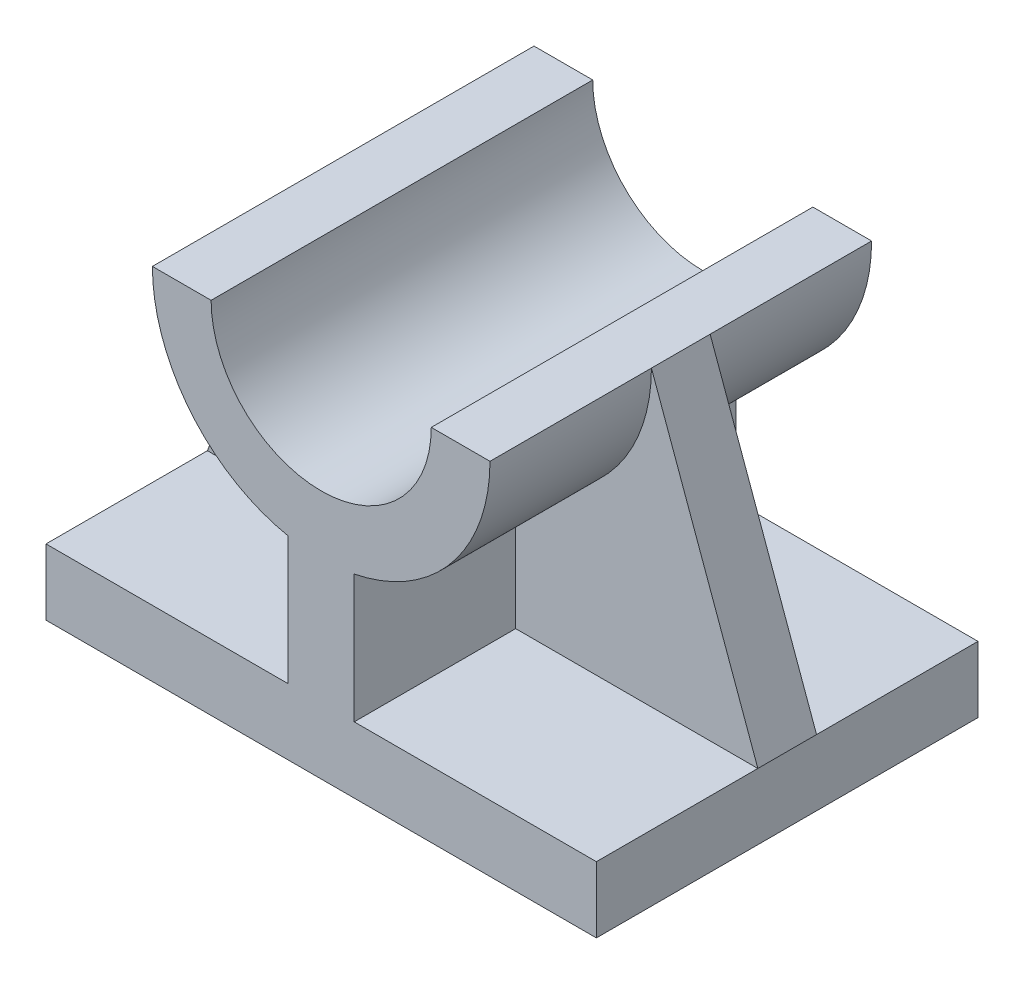
ISO-10303-21;
HEADER;
FILE_DESCRIPTION(('STEP AP214'),'2;1');
FILE_NAME('part.step','',(''),(''),'','','');
FILE_SCHEMA(('AUTOMOTIVE_DESIGN { 1 0 10303 214 1 1 1 1 }'));
ENDSEC;
DATA;
#1=APPLICATION_CONTEXT('core data for automotive mechanical design processes');
#2=APPLICATION_PROTOCOL_DEFINITION('international standard','automotive_design',2000,#1);
#3=PRODUCT_CONTEXT('',#1,'mechanical');
#4=PRODUCT('Part','Part','',(#3));
#5=PRODUCT_RELATED_PRODUCT_CATEGORY('part','',(#4));
#6=PRODUCT_DEFINITION_FORMATION('','',#4);
#7=PRODUCT_DEFINITION_CONTEXT('part definition',#1,'design');
#8=PRODUCT_DEFINITION('design','',#6,#7);
#9=PRODUCT_DEFINITION_SHAPE('','',#8);
#10=(LENGTH_UNIT() NAMED_UNIT(*) SI_UNIT(.MILLI.,.METRE.));
#11=(NAMED_UNIT(*) PLANE_ANGLE_UNIT() SI_UNIT($,.RADIAN.));
#12=(NAMED_UNIT(*) SI_UNIT($,.STERADIAN.) SOLID_ANGLE_UNIT());
#13=UNCERTAINTY_MEASURE_WITH_UNIT(LENGTH_MEASURE(1.E-05),#10,'distance_accuracy_value','');
#14=(GEOMETRIC_REPRESENTATION_CONTEXT(3) GLOBAL_UNCERTAINTY_ASSIGNED_CONTEXT((#13)) GLOBAL_UNIT_ASSIGNED_CONTEXT((#10,
#11,#12)) REPRESENTATION_CONTEXT('',''));
#15=CARTESIAN_POINT('',(0.,0.,0.));
#16=DIRECTION('',(0.,0.,1.));
#17=DIRECTION('',(1.,0.,0.));
#18=AXIS2_PLACEMENT_3D('',#15,#16,#17);
#19=CARTESIAN_POINT('',(-37.5,4.5,-26.));
#20=DIRECTION('',(0.,1.,0.));
#21=DIRECTION('',(-1.,0.,0.));
#22=AXIS2_PLACEMENT_3D('',#19,#20,#21);
#23=PLANE('',#22);
#24=DIRECTION('',(0.,0.,1.));
#25=VECTOR('',#24,1.);
#26=CARTESIAN_POINT('',(-37.5,4.5,-26.));
#27=LINE('',#26,#25);
#28=CARTESIAN_POINT('',(-37.5,4.5,-26.));
#29=VERTEX_POINT('',#28);
#30=CARTESIAN_POINT('',(-37.5,4.5,-4.));
#31=VERTEX_POINT('',#30);
#32=EDGE_CURVE('E267',#29,#31,#27,.T.);
#33=ORIENTED_EDGE('',*,*,#32,.T.);
#34=DIRECTION('',(1.,0.,0.));
#35=VECTOR('',#34,1.);
#36=CARTESIAN_POINT('',(-37.5,4.5,-4.));
#37=LINE('',#36,#35);
#38=CARTESIAN_POINT('',(-4.5,4.5,-4.));
#39=VERTEX_POINT('',#38);
#40=EDGE_CURVE('E200',#31,#39,#37,.T.);
#41=ORIENTED_EDGE('',*,*,#40,.T.);
#42=DIRECTION('',(0.,0.,1.));
#43=VECTOR('',#42,1.);
#44=CARTESIAN_POINT('',(-4.5,4.5,-26.));
#45=LINE('',#44,#43);
#46=CARTESIAN_POINT('',(-4.5,4.5,-26.));
#47=VERTEX_POINT('',#46);
#48=EDGE_CURVE('E277',#47,#39,#45,.T.);
#49=ORIENTED_EDGE('',*,*,#48,.F.);
#50=DIRECTION('',(-1.,0.,0.));
#51=VECTOR('',#50,1.);
#52=CARTESIAN_POINT('',(-37.5,4.5,-26.));
#53=LINE('',#52,#51);
#54=EDGE_CURVE('E357',#47,#29,#53,.T.);
#55=ORIENTED_EDGE('',*,*,#54,.T.);
#56=EDGE_LOOP('',(#33,#41,#49,#55));
#57=FACE_BOUND('',#56,.T.);
#58=ADVANCED_FACE('F47',(#57),#23,.T.);
#59=CARTESIAN_POINT('',(-4.5,4.5,-26.));
#60=DIRECTION('',(-1.,0.,0.));
#61=DIRECTION('',(0.,0.,1.));
#62=AXIS2_PLACEMENT_3D('',#59,#60,#61);
#63=PLANE('',#62);
#64=ORIENTED_EDGE('',*,*,#48,.T.);
#65=DIRECTION('',(0.,1.,0.));
#66=VECTOR('',#65,1.);
#67=CARTESIAN_POINT('',(-4.5,4.5,-4.));
#68=LINE('',#67,#66);
#69=CARTESIAN_POINT('',(-4.5,21.9445128627201,-4.));
#70=VERTEX_POINT('',#69);
#71=EDGE_CURVE('E211',#39,#70,#68,.T.);
#72=ORIENTED_EDGE('',*,*,#71,.T.);
#73=DIRECTION('',(0.,0.,1.));
#74=VECTOR('',#73,1.);
#75=CARTESIAN_POINT('',(-4.5,21.9445128627201,-26.));
#76=LINE('',#75,#74);
#77=CARTESIAN_POINT('',(-4.5,21.9445128627201,-26.));
#78=VERTEX_POINT('',#77);
#79=EDGE_CURVE('E208',#78,#70,#76,.T.);
#80=ORIENTED_EDGE('',*,*,#79,.F.);
#81=DIRECTION('',(0.,-1.,0.));
#82=VECTOR('',#81,1.);
#83=CARTESIAN_POINT('',(-4.5,4.5,-26.));
#84=LINE('',#83,#82);
#85=EDGE_CURVE('E353',#78,#47,#84,.T.);
#86=ORIENTED_EDGE('',*,*,#85,.T.);
#87=EDGE_LOOP('',(#64,#72,#80,#86));
#88=FACE_BOUND('',#87,.T.);
#89=ADVANCED_FACE('F475',(#88),#63,.T.);
#90=CARTESIAN_POINT('',(0.,44.5,-26.));
#91=DIRECTION('',(0.,0.,1.));
#92=DIRECTION('',(1.,0.,0.));
#93=AXIS2_PLACEMENT_3D('',#90,#91,#92);
#94=CYLINDRICAL_SURFACE('',#93,23.);
#95=ORIENTED_EDGE('',*,*,#79,.T.);
#96=CARTESIAN_POINT('',(0.,44.5,-4.));
#97=DIRECTION('',(0.,0.,1.));
#98=DIRECTION('',(1.,0.,0.));
#99=AXIS2_PLACEMENT_3D('',#96,#97,#98);
#100=CIRCLE('',#99,23.);
#101=CARTESIAN_POINT('',(-23.,44.5,-4.));
#102=VERTEX_POINT('',#101);
#103=EDGE_CURVE('E197',#70,#102,#100,.F.);
#104=ORIENTED_EDGE('',*,*,#103,.T.);
#105=DIRECTION('',(0.,0.,1.));
#106=VECTOR('',#105,1.);
#107=CARTESIAN_POINT('',(-23.,44.5,-26.));
#108=LINE('',#107,#106);
#109=CARTESIAN_POINT('',(-23.,44.5,-26.));
#110=VERTEX_POINT('',#109);
#111=EDGE_CURVE('E191',#110,#102,#108,.T.);
#112=ORIENTED_EDGE('',*,*,#111,.F.);
#113=CARTESIAN_POINT('',(0.,44.5,-26.));
#114=DIRECTION('',(0.,0.,1.));
#115=DIRECTION('',(1.,0.,0.));
#116=AXIS2_PLACEMENT_3D('',#113,#114,#115);
#117=CIRCLE('',#116,23.);
#118=EDGE_CURVE('E350',#110,#78,#117,.T.);
#119=ORIENTED_EDGE('',*,*,#118,.T.);
#120=EDGE_LOOP('',(#95,#104,#112,#119));
#121=FACE_BOUND('',#120,.T.);
#122=ADVANCED_FACE('F205',(#121),#94,.T.);
#123=CARTESIAN_POINT('',(0.,44.5,-26.));
#124=DIRECTION('',(0.,0.,1.));
#125=DIRECTION('',(1.,0.,0.));
#126=AXIS2_PLACEMENT_3D('',#123,#124,#125);
#127=CYLINDRICAL_SURFACE('',#126,23.);
#128=DIRECTION('',(0.,0.,1.));
#129=VECTOR('',#128,1.);
#130=CARTESIAN_POINT('',(23.,44.5,-26.));
#131=LINE('',#130,#129);
#132=CARTESIAN_POINT('',(23.,44.5,-26.));
#133=VERTEX_POINT('',#132);
#134=CARTESIAN_POINT('',(23.,44.5,-4.));
#135=VERTEX_POINT('',#134);
#136=EDGE_CURVE('E233',#133,#135,#131,.T.);
#137=ORIENTED_EDGE('',*,*,#136,.T.);
#138=CARTESIAN_POINT('',(0.,44.5,-4.));
#139=DIRECTION('',(0.,0.,1.));
#140=DIRECTION('',(1.,0.,0.));
#141=AXIS2_PLACEMENT_3D('',#138,#139,#140);
#142=CIRCLE('',#141,23.);
#143=CARTESIAN_POINT('',(4.5,21.9445128627201,-4.));
#144=VERTEX_POINT('',#143);
#145=EDGE_CURVE('E407',#135,#144,#142,.F.);
#146=ORIENTED_EDGE('',*,*,#145,.T.);
#147=DIRECTION('',(0.,0.,1.));
#148=VECTOR('',#147,1.);
#149=CARTESIAN_POINT('',(4.50000000000001,21.9445128627201,-26.));
#150=LINE('',#149,#148);
#151=CARTESIAN_POINT('',(4.50000000000001,21.9445128627201,-26.));
#152=VERTEX_POINT('',#151);
#153=EDGE_CURVE('E240',#152,#144,#150,.T.);
#154=ORIENTED_EDGE('',*,*,#153,.F.);
#155=CARTESIAN_POINT('',(0.,44.5,-26.));
#156=DIRECTION('',(0.,0.,1.));
#157=DIRECTION('',(1.,0.,0.));
#158=AXIS2_PLACEMENT_3D('',#155,#156,#157);
#159=CIRCLE('',#158,23.);
#160=EDGE_CURVE('E337',#152,#133,#159,.T.);
#161=ORIENTED_EDGE('',*,*,#160,.T.);
#162=EDGE_LOOP('',(#137,#146,#154,#161));
#163=FACE_BOUND('',#162,.T.);
#164=ADVANCED_FACE('F405',(#163),#127,.T.);
#165=CARTESIAN_POINT('',(4.5,4.5,-26.));
#166=DIRECTION('',(1.,0.,0.));
#167=DIRECTION('',(0.,0.,-1.));
#168=AXIS2_PLACEMENT_3D('',#165,#166,#167);
#169=PLANE('',#168);
#170=ORIENTED_EDGE('',*,*,#153,.T.);
#171=DIRECTION('',(0.,-1.,0.));
#172=VECTOR('',#171,1.);
#173=CARTESIAN_POINT('',(4.5,4.5,-4.));
#174=LINE('',#173,#172);
#175=CARTESIAN_POINT('',(4.5,4.5,-4.));
#176=VERTEX_POINT('',#175);
#177=EDGE_CURVE('E411',#144,#176,#174,.T.);
#178=ORIENTED_EDGE('',*,*,#177,.T.);
#179=DIRECTION('',(0.,0.,1.));
#180=VECTOR('',#179,1.);
#181=CARTESIAN_POINT('',(4.5,4.5,-26.));
#182=LINE('',#181,#180);
#183=CARTESIAN_POINT('',(4.5,4.5,-26.));
#184=VERTEX_POINT('',#183);
#185=EDGE_CURVE('E245',#184,#176,#182,.T.);
#186=ORIENTED_EDGE('',*,*,#185,.F.);
#187=DIRECTION('',(0.,1.,0.));
#188=VECTOR('',#187,1.);
#189=CARTESIAN_POINT('',(4.5,4.5,-26.));
#190=LINE('',#189,#188);
#191=EDGE_CURVE('E328',#184,#152,#190,.T.);
#192=ORIENTED_EDGE('',*,*,#191,.T.);
#193=EDGE_LOOP('',(#170,#178,#186,#192));
#194=FACE_BOUND('',#193,.T.);
#195=ADVANCED_FACE('F410',(#194),#169,.T.);
#196=CARTESIAN_POINT('',(4.5,4.5,-26.));
#197=DIRECTION('',(0.,1.,0.));
#198=DIRECTION('',(-1.,0.,0.));
#199=AXIS2_PLACEMENT_3D('',#196,#197,#198);
#200=PLANE('',#199);
#201=ORIENTED_EDGE('',*,*,#185,.T.);
#202=DIRECTION('',(1.,0.,0.));
#203=VECTOR('',#202,1.);
#204=CARTESIAN_POINT('',(4.5,4.5,-4.));
#205=LINE('',#204,#203);
#206=CARTESIAN_POINT('',(37.5,4.5,-4.00000000000001));
#207=VERTEX_POINT('',#206);
#208=EDGE_CURVE('E56',#176,#207,#205,.T.);
#209=ORIENTED_EDGE('',*,*,#208,.T.);
#210=DIRECTION('',(0.,0.,1.));
#211=VECTOR('',#210,1.);
#212=CARTESIAN_POINT('',(37.5,4.5,-26.));
#213=LINE('',#212,#211);
#214=CARTESIAN_POINT('',(37.5,4.5,-26.));
#215=VERTEX_POINT('',#214);
#216=EDGE_CURVE('E250',#215,#207,#213,.T.);
#217=ORIENTED_EDGE('',*,*,#216,.F.);
#218=DIRECTION('',(-1.,0.,0.));
#219=VECTOR('',#218,1.);
#220=CARTESIAN_POINT('',(4.5,4.5,-26.));
#221=LINE('',#220,#219);
#222=EDGE_CURVE('E322',#215,#184,#221,.T.);
#223=ORIENTED_EDGE('',*,*,#222,.T.);
#224=EDGE_LOOP('',(#201,#209,#217,#223));
#225=FACE_BOUND('',#224,.T.);
#226=ADVANCED_FACE('F413',(#225),#200,.T.);
#227=CARTESIAN_POINT('',(37.5,4.5,-26.));
#228=DIRECTION('',(1.,0.,0.));
#229=DIRECTION('',(0.,0.,-1.));
#230=AXIS2_PLACEMENT_3D('',#227,#228,#229);
#231=PLANE('',#230);
#232=DIRECTION('',(0.,1.,0.));
#233=VECTOR('',#232,1.);
#234=CARTESIAN_POINT('',(37.5,4.5,26.));
#235=LINE('',#234,#233);
#236=CARTESIAN_POINT('',(37.5,-4.5,26.));
#237=VERTEX_POINT('',#236);
#238=CARTESIAN_POINT('',(37.5,4.5,26.));
#239=VERTEX_POINT('',#238);
#240=EDGE_CURVE('E368',#237,#239,#235,.T.);
#241=ORIENTED_EDGE('',*,*,#240,.F.);
#242=DIRECTION('',(0.,0.,1.));
#243=VECTOR('',#242,1.);
#244=CARTESIAN_POINT('',(37.5,-4.5,-26.));
#245=LINE('',#244,#243);
#246=CARTESIAN_POINT('',(37.5,-4.5,-26.));
#247=VERTEX_POINT('',#246);
#248=EDGE_CURVE('E257',#247,#237,#245,.T.);
#249=ORIENTED_EDGE('',*,*,#248,.F.);
#250=DIRECTION('',(0.,1.,0.));
#251=VECTOR('',#250,1.);
#252=CARTESIAN_POINT('',(37.5,4.5,-26.));
#253=LINE('',#252,#251);
#254=EDGE_CURVE('E319',#247,#215,#253,.T.);
#255=ORIENTED_EDGE('',*,*,#254,.T.);
#256=ORIENTED_EDGE('',*,*,#216,.T.);
#257=CARTESIAN_POINT('',(37.5,4.5,4.));
#258=VERTEX_POINT('',#257);
#259=EDGE_CURVE('E253',#207,#258,#213,.T.);
#260=ORIENTED_EDGE('',*,*,#259,.T.);
#261=EDGE_CURVE('E254',#258,#239,#213,.T.);
#262=ORIENTED_EDGE('',*,*,#261,.T.);
#263=EDGE_LOOP('',(#241,#249,#255,#256,#260,#262));
#264=FACE_BOUND('',#263,.T.);
#265=ADVANCED_FACE('F49',(#264),#231,.T.);
#266=CARTESIAN_POINT('',(-37.5,-4.5,-26.));
#267=DIRECTION('',(0.,-1.,0.));
#268=DIRECTION('',(0.,0.,-1.));
#269=AXIS2_PLACEMENT_3D('',#266,#267,#268);
#270=PLANE('',#269);
#271=DIRECTION('',(1.,0.,0.));
#272=VECTOR('',#271,1.);
#273=CARTESIAN_POINT('',(-37.5,-4.5,26.));
#274=LINE('',#273,#272);
#275=CARTESIAN_POINT('',(-37.5,-4.5,26.));
#276=VERTEX_POINT('',#275);
#277=EDGE_CURVE('E270',#276,#237,#274,.T.);
#278=ORIENTED_EDGE('',*,*,#277,.F.);
#279=DIRECTION('',(0.,0.,1.));
#280=VECTOR('',#279,1.);
#281=CARTESIAN_POINT('',(-37.5,-4.5,-26.));
#282=LINE('',#281,#280);
#283=CARTESIAN_POINT('',(-37.5,-4.5,-26.));
#284=VERTEX_POINT('',#283);
#285=EDGE_CURVE('E260',#284,#276,#282,.T.);
#286=ORIENTED_EDGE('',*,*,#285,.F.);
#287=DIRECTION('',(1.,0.,0.));
#288=VECTOR('',#287,1.);
#289=CARTESIAN_POINT('',(-37.5,-4.5,-26.));
#290=LINE('',#289,#288);
#291=EDGE_CURVE('E365',#284,#247,#290,.T.);
#292=ORIENTED_EDGE('',*,*,#291,.T.);
#293=ORIENTED_EDGE('',*,*,#248,.T.);
#294=EDGE_LOOP('',(#278,#286,#292,#293));
#295=FACE_BOUND('',#294,.T.);
#296=ADVANCED_FACE('F471',(#295),#270,.T.);
#297=CARTESIAN_POINT('',(-37.5,4.5,-26.));
#298=DIRECTION('',(-1.,0.,0.));
#299=DIRECTION('',(0.,0.,1.));
#300=AXIS2_PLACEMENT_3D('',#297,#298,#299);
#301=PLANE('',#300);
#302=CARTESIAN_POINT('',(-37.5,4.5,4.));
#303=VERTEX_POINT('',#302);
#304=CARTESIAN_POINT('',(-37.5,4.5,26.));
#305=VERTEX_POINT('',#304);
#306=EDGE_CURVE('E276',#303,#305,#27,.T.);
#307=ORIENTED_EDGE('',*,*,#306,.F.);
#308=DIRECTION('',(0.,0.,1.));
#309=VECTOR('',#308,1.);
#310=CARTESIAN_POINT('',(-37.5,4.5,-26.));
#311=LINE('',#310,#309);
#312=EDGE_CURVE('E446',#31,#303,#311,.T.);
#313=ORIENTED_EDGE('',*,*,#312,.F.);
#314=ORIENTED_EDGE('',*,*,#32,.F.);
#315=DIRECTION('',(0.,-1.,0.));
#316=VECTOR('',#315,1.);
#317=CARTESIAN_POINT('',(-37.5,4.5,-26.));
#318=LINE('',#317,#316);
#319=EDGE_CURVE('E361',#29,#284,#318,.T.);
#320=ORIENTED_EDGE('',*,*,#319,.T.);
#321=ORIENTED_EDGE('',*,*,#285,.T.);
#322=DIRECTION('',(0.,-1.,0.));
#323=VECTOR('',#322,1.);
#324=CARTESIAN_POINT('',(-37.5,4.5,26.));
#325=LINE('',#324,#323);
#326=EDGE_CURVE('E304',#305,#276,#325,.T.);
#327=ORIENTED_EDGE('',*,*,#326,.F.);
#328=EDGE_LOOP('',(#307,#313,#314,#320,#321,#327));
#329=FACE_BOUND('',#328,.T.);
#330=ADVANCED_FACE('F467',(#329),#301,.T.);
#331=DIRECTION('',(1.,0.,0.));
#332=VECTOR('',#331,1.);
#333=CARTESIAN_POINT('',(-37.5,4.5,4.));
#334=LINE('',#333,#332);
#335=CARTESIAN_POINT('',(-4.5,4.5,4.));
#336=VERTEX_POINT('',#335);
#337=EDGE_CURVE('E451',#303,#336,#334,.T.);
#338=ORIENTED_EDGE('',*,*,#337,.F.);
#339=ORIENTED_EDGE('',*,*,#306,.T.);
#340=DIRECTION('',(-1.,0.,0.));
#341=VECTOR('',#340,1.);
#342=CARTESIAN_POINT('',(-37.5,4.5,26.));
#343=LINE('',#342,#341);
#344=CARTESIAN_POINT('',(-4.5,4.5,26.));
#345=VERTEX_POINT('',#344);
#346=EDGE_CURVE('E297',#345,#305,#343,.T.);
#347=ORIENTED_EDGE('',*,*,#346,.F.);
#348=EDGE_CURVE('E280',#336,#345,#45,.T.);
#349=ORIENTED_EDGE('',*,*,#348,.F.);
#350=EDGE_LOOP('',(#338,#339,#347,#349));
#351=FACE_BOUND('',#350,.T.);
#352=ADVANCED_FACE('F298',(#351),#23,.T.);
#353=DIRECTION('',(0.,1.,0.));
#354=VECTOR('',#353,1.);
#355=CARTESIAN_POINT('',(-4.5,4.5,4.));
#356=LINE('',#355,#354);
#357=CARTESIAN_POINT('',(-4.5,21.9445128627201,4.));
#358=VERTEX_POINT('',#357);
#359=EDGE_CURVE('E293',#336,#358,#356,.T.);
#360=ORIENTED_EDGE('',*,*,#359,.F.);
#361=ORIENTED_EDGE('',*,*,#348,.T.);
#362=DIRECTION('',(0.,-1.,0.));
#363=VECTOR('',#362,1.);
#364=CARTESIAN_POINT('',(-4.5,4.5,26.));
#365=LINE('',#364,#363);
#366=CARTESIAN_POINT('',(-4.5,21.9445128627201,26.));
#367=VERTEX_POINT('',#366);
#368=EDGE_CURVE('E291',#367,#345,#365,.T.);
#369=ORIENTED_EDGE('',*,*,#368,.F.);
#370=EDGE_CURVE('E219',#358,#367,#76,.T.);
#371=ORIENTED_EDGE('',*,*,#370,.F.);
#372=EDGE_LOOP('',(#360,#361,#369,#371));
#373=FACE_BOUND('',#372,.T.);
#374=ADVANCED_FACE('F288',(#373),#63,.T.);
#375=CARTESIAN_POINT('',(0.,44.5,4.));
#376=DIRECTION('',(0.,0.,1.));
#377=DIRECTION('',(1.,0.,0.));
#378=AXIS2_PLACEMENT_3D('',#375,#376,#377);
#379=CIRCLE('',#378,23.);
#380=CARTESIAN_POINT('',(-23.,44.5,3.99999999999999));
#381=VERTEX_POINT('',#380);
#382=EDGE_CURVE('E210',#358,#381,#379,.F.);
#383=ORIENTED_EDGE('',*,*,#382,.F.);
#384=ORIENTED_EDGE('',*,*,#370,.T.);
#385=CARTESIAN_POINT('',(0.,44.5,26.));
#386=DIRECTION('',(0.,0.,1.));
#387=DIRECTION('',(1.,0.,0.));
#388=AXIS2_PLACEMENT_3D('',#385,#386,#387);
#389=CIRCLE('',#388,23.);
#390=CARTESIAN_POINT('',(-23.,44.5,26.));
#391=VERTEX_POINT('',#390);
#392=EDGE_CURVE('E309',#391,#367,#389,.T.);
#393=ORIENTED_EDGE('',*,*,#392,.F.);
#394=EDGE_CURVE('E192',#381,#391,#108,.T.);
#395=ORIENTED_EDGE('',*,*,#394,.F.);
#396=EDGE_LOOP('',(#383,#384,#393,#395));
#397=FACE_BOUND('',#396,.T.);
#398=ADVANCED_FACE('F483',(#397),#94,.T.);
#399=CARTESIAN_POINT('',(-23.,44.5,-26.));
#400=DIRECTION('',(0.,1.,0.));
#401=DIRECTION('',(0.,0.,1.));
#402=AXIS2_PLACEMENT_3D('',#399,#400,#401);
#403=PLANE('',#402);
#404=DIRECTION('',(-1.,0.,0.));
#405=VECTOR('',#404,1.);
#406=CARTESIAN_POINT('',(-23.,44.5,26.));
#407=LINE('',#406,#405);
#408=CARTESIAN_POINT('',(-15.,44.5,26.));
#409=VERTEX_POINT('',#408);
#410=EDGE_CURVE('E313',#409,#391,#407,.T.);
#411=ORIENTED_EDGE('',*,*,#410,.F.);
#412=DIRECTION('',(0.,0.,1.));
#413=VECTOR('',#412,1.);
#414=CARTESIAN_POINT('',(-15.,44.5,-26.));
#415=LINE('',#414,#413);
#416=CARTESIAN_POINT('',(-15.,44.5,-26.));
#417=VERTEX_POINT('',#416);
#418=EDGE_CURVE('E224',#417,#409,#415,.T.);
#419=ORIENTED_EDGE('',*,*,#418,.F.);
#420=DIRECTION('',(-1.,0.,0.));
#421=VECTOR('',#420,1.);
#422=CARTESIAN_POINT('',(-23.,44.5,-26.));
#423=LINE('',#422,#421);
#424=EDGE_CURVE('E217',#417,#110,#423,.T.);
#425=ORIENTED_EDGE('',*,*,#424,.T.);
#426=ORIENTED_EDGE('',*,*,#111,.T.);
#427=EDGE_CURVE('E183',#102,#381,#108,.T.);
#428=ORIENTED_EDGE('',*,*,#427,.T.);
#429=ORIENTED_EDGE('',*,*,#394,.T.);
#430=EDGE_LOOP('',(#411,#419,#425,#426,#428,#429));
#431=FACE_BOUND('',#430,.T.);
#432=ADVANCED_FACE('F215',(#431),#403,.T.);
#433=CARTESIAN_POINT('',(0.,44.5,-26.));
#434=DIRECTION('',(0.,0.,1.));
#435=DIRECTION('',(1.,0.,0.));
#436=AXIS2_PLACEMENT_3D('',#433,#434,#435);
#437=CYLINDRICAL_SURFACE('',#436,15.);
#438=CARTESIAN_POINT('',(0.,44.5,26.));
#439=DIRECTION('',(0.,0.,-1.));
#440=DIRECTION('',(1.,0.,0.));
#441=AXIS2_PLACEMENT_3D('',#438,#439,#440);
#442=CIRCLE('',#441,15.);
#443=CARTESIAN_POINT('',(15.,44.5,26.));
#444=VERTEX_POINT('',#443);
#445=EDGE_CURVE('E387',#444,#409,#442,.T.);
#446=ORIENTED_EDGE('',*,*,#445,.F.);
#447=DIRECTION('',(0.,0.,1.));
#448=VECTOR('',#447,1.);
#449=CARTESIAN_POINT('',(15.,44.5,-26.));
#450=LINE('',#449,#448);
#451=CARTESIAN_POINT('',(15.,44.5,-26.));
#452=VERTEX_POINT('',#451);
#453=EDGE_CURVE('E228',#452,#444,#450,.T.);
#454=ORIENTED_EDGE('',*,*,#453,.F.);
#455=CARTESIAN_POINT('',(0.,44.5,-26.));
#456=DIRECTION('',(0.,0.,-1.));
#457=DIRECTION('',(1.,0.,0.));
#458=AXIS2_PLACEMENT_3D('',#455,#456,#457);
#459=CIRCLE('',#458,15.);
#460=EDGE_CURVE('E345',#452,#417,#459,.T.);
#461=ORIENTED_EDGE('',*,*,#460,.T.);
#462=ORIENTED_EDGE('',*,*,#418,.T.);
#463=EDGE_LOOP('',(#446,#454,#461,#462));
#464=FACE_BOUND('',#463,.T.);
#465=ADVANCED_FACE('F396',(#464),#437,.F.);
#466=CARTESIAN_POINT('',(15.,44.5,-26.));
#467=DIRECTION('',(0.,1.,0.));
#468=DIRECTION('',(0.,0.,1.));
#469=AXIS2_PLACEMENT_3D('',#466,#467,#468);
#470=PLANE('',#469);
#471=CARTESIAN_POINT('',(23.,44.5,4.));
#472=VERTEX_POINT('',#471);
#473=CARTESIAN_POINT('',(23.,44.5,26.));
#474=VERTEX_POINT('',#473);
#475=EDGE_CURVE('E239',#472,#474,#131,.T.);
#476=ORIENTED_EDGE('',*,*,#475,.F.);
#477=DIRECTION('',(0.,0.,1.));
#478=VECTOR('',#477,1.);
#479=CARTESIAN_POINT('',(23.,44.5,-26.));
#480=LINE('',#479,#478);
#481=EDGE_CURVE('E331',#135,#472,#480,.T.);
#482=ORIENTED_EDGE('',*,*,#481,.F.);
#483=ORIENTED_EDGE('',*,*,#136,.F.);
#484=DIRECTION('',(-1.,0.,0.));
#485=VECTOR('',#484,1.);
#486=CARTESIAN_POINT('',(15.,44.5,-26.));
#487=LINE('',#486,#485);
#488=EDGE_CURVE('E341',#133,#452,#487,.T.);
#489=ORIENTED_EDGE('',*,*,#488,.T.);
#490=ORIENTED_EDGE('',*,*,#453,.T.);
#491=DIRECTION('',(-1.,0.,0.));
#492=VECTOR('',#491,1.);
#493=CARTESIAN_POINT('',(15.,44.5,26.));
#494=LINE('',#493,#492);
#495=EDGE_CURVE('E383',#474,#444,#494,.T.);
#496=ORIENTED_EDGE('',*,*,#495,.F.);
#497=EDGE_LOOP('',(#476,#482,#483,#489,#490,#496));
#498=FACE_BOUND('',#497,.T.);
#499=ADVANCED_FACE('F400',(#498),#470,.T.);
#500=CARTESIAN_POINT('',(0.,44.5,4.));
#501=DIRECTION('',(0.,0.,1.));
#502=DIRECTION('',(1.,0.,0.));
#503=AXIS2_PLACEMENT_3D('',#500,#501,#502);
#504=CIRCLE('',#503,23.);
#505=CARTESIAN_POINT('',(4.5,21.9445128627201,4.));
#506=VERTEX_POINT('',#505);
#507=EDGE_CURVE('E429',#472,#506,#504,.F.);
#508=ORIENTED_EDGE('',*,*,#507,.F.);
#509=ORIENTED_EDGE('',*,*,#475,.T.);
#510=CARTESIAN_POINT('',(0.,44.5,26.));
#511=DIRECTION('',(0.,0.,1.));
#512=DIRECTION('',(1.,0.,0.));
#513=AXIS2_PLACEMENT_3D('',#510,#511,#512);
#514=CIRCLE('',#513,23.);
#515=CARTESIAN_POINT('',(4.50000000000001,21.9445128627201,26.));
#516=VERTEX_POINT('',#515);
#517=EDGE_CURVE('E379',#516,#474,#514,.T.);
#518=ORIENTED_EDGE('',*,*,#517,.F.);
#519=EDGE_CURVE('E244',#506,#516,#150,.T.);
#520=ORIENTED_EDGE('',*,*,#519,.F.);
#521=EDGE_LOOP('',(#508,#509,#518,#520));
#522=FACE_BOUND('',#521,.T.);
#523=ADVANCED_FACE('F427',(#522),#127,.T.);
#524=DIRECTION('',(0.,-1.,0.));
#525=VECTOR('',#524,1.);
#526=CARTESIAN_POINT('',(4.5,4.5,4.));
#527=LINE('',#526,#525);
#528=CARTESIAN_POINT('',(4.5,4.5,4.));
#529=VERTEX_POINT('',#528);
#530=EDGE_CURVE('E433',#506,#529,#527,.T.);
#531=ORIENTED_EDGE('',*,*,#530,.F.);
#532=ORIENTED_EDGE('',*,*,#519,.T.);
#533=DIRECTION('',(0.,1.,0.));
#534=VECTOR('',#533,1.);
#535=CARTESIAN_POINT('',(4.5,4.5,26.));
#536=LINE('',#535,#534);
#537=CARTESIAN_POINT('',(4.5,4.5,26.));
#538=VERTEX_POINT('',#537);
#539=EDGE_CURVE('E375',#538,#516,#536,.T.);
#540=ORIENTED_EDGE('',*,*,#539,.F.);
#541=EDGE_CURVE('E249',#529,#538,#182,.T.);
#542=ORIENTED_EDGE('',*,*,#541,.F.);
#543=EDGE_LOOP('',(#531,#532,#540,#542));
#544=FACE_BOUND('',#543,.T.);
#545=ADVANCED_FACE('F627',(#544),#169,.T.);
#546=DIRECTION('',(1.,0.,0.));
#547=VECTOR('',#546,1.);
#548=CARTESIAN_POINT('',(4.5,4.5,4.));
#549=LINE('',#548,#547);
#550=EDGE_CURVE('E11',#529,#258,#549,.T.);
#551=ORIENTED_EDGE('',*,*,#550,.F.);
#552=ORIENTED_EDGE('',*,*,#541,.T.);
#553=DIRECTION('',(-1.,0.,0.));
#554=VECTOR('',#553,1.);
#555=CARTESIAN_POINT('',(4.5,4.5,26.));
#556=LINE('',#555,#554);
#557=EDGE_CURVE('E371',#239,#538,#556,.T.);
#558=ORIENTED_EDGE('',*,*,#557,.F.);
#559=ORIENTED_EDGE('',*,*,#261,.F.);
#560=EDGE_LOOP('',(#551,#552,#558,#559));
#561=FACE_BOUND('',#560,.T.);
#562=ADVANCED_FACE('F503',(#561),#200,.T.);
#563=CARTESIAN_POINT('',(0.,44.5,-26.));
#564=DIRECTION('',(0.,0.,1.));
#565=DIRECTION('',(1.,0.,0.));
#566=AXIS2_PLACEMENT_3D('',#563,#564,#565);
#567=PLANE('',#566);
#568=ORIENTED_EDGE('',*,*,#254,.F.);
#569=ORIENTED_EDGE('',*,*,#291,.F.);
#570=ORIENTED_EDGE('',*,*,#319,.F.);
#571=ORIENTED_EDGE('',*,*,#54,.F.);
#572=ORIENTED_EDGE('',*,*,#85,.F.);
#573=ORIENTED_EDGE('',*,*,#118,.F.);
#574=ORIENTED_EDGE('',*,*,#424,.F.);
#575=ORIENTED_EDGE('',*,*,#460,.F.);
#576=ORIENTED_EDGE('',*,*,#488,.F.);
#577=ORIENTED_EDGE('',*,*,#160,.F.);
#578=ORIENTED_EDGE('',*,*,#191,.F.);
#579=ORIENTED_EDGE('',*,*,#222,.F.);
#580=EDGE_LOOP('',(#568,#569,#570,#571,#572,#573,#574,#575,#576,#577,#578,#579));
#581=FACE_BOUND('',#580,.T.);
#582=ADVANCED_FACE('F393',(#581),#567,.F.);
#583=CARTESIAN_POINT('',(0.,44.5,26.));
#584=DIRECTION('',(0.,0.,1.));
#585=DIRECTION('',(1.,0.,0.));
#586=AXIS2_PLACEMENT_3D('',#583,#584,#585);
#587=PLANE('',#586);
#588=ORIENTED_EDGE('',*,*,#240,.T.);
#589=ORIENTED_EDGE('',*,*,#557,.T.);
#590=ORIENTED_EDGE('',*,*,#539,.T.);
#591=ORIENTED_EDGE('',*,*,#517,.T.);
#592=ORIENTED_EDGE('',*,*,#495,.T.);
#593=ORIENTED_EDGE('',*,*,#445,.T.);
#594=ORIENTED_EDGE('',*,*,#410,.T.);
#595=ORIENTED_EDGE('',*,*,#392,.T.);
#596=ORIENTED_EDGE('',*,*,#368,.T.);
#597=ORIENTED_EDGE('',*,*,#346,.T.);
#598=ORIENTED_EDGE('',*,*,#326,.T.);
#599=ORIENTED_EDGE('',*,*,#277,.T.);
#600=EDGE_LOOP('',(#588,#589,#590,#591,#592,#593,#594,#595,#596,#597,#598,#599));
#601=FACE_BOUND('',#600,.T.);
#602=ADVANCED_FACE('F307',(#601),#587,.T.);
#603=CARTESIAN_POINT('',(23.,44.5,0.));
#604=DIRECTION('',(-0.940136065162483,-0.340799323621401,0.));
#605=DIRECTION('',(0.340799323621401,-0.940136065162483,0.));
#606=AXIS2_PLACEMENT_3D('',#603,#604,#605);
#607=PLANE('',#606);
#608=DIRECTION('',(0.340799323621401,-0.940136065162483,0.));
#609=VECTOR('',#608,1.);
#610=CARTESIAN_POINT('',(23.,44.5,-4.));
#611=LINE('',#610,#609);
#612=EDGE_CURVE('E71',#135,#207,#611,.T.);
#613=ORIENTED_EDGE('',*,*,#612,.F.);
#614=ORIENTED_EDGE('',*,*,#481,.T.);
#615=DIRECTION('',(0.340799323621401,-0.940136065162483,0.));
#616=VECTOR('',#615,1.);
#617=CARTESIAN_POINT('',(23.,44.5,4.));
#618=LINE('',#617,#616);
#619=EDGE_CURVE('E443',#472,#258,#618,.T.);
#620=ORIENTED_EDGE('',*,*,#619,.T.);
#621=ORIENTED_EDGE('',*,*,#259,.F.);
#622=EDGE_LOOP('',(#613,#614,#620,#621));
#623=FACE_BOUND('',#622,.T.);
#624=ADVANCED_FACE('F500',(#623),#607,.F.);
#625=CARTESIAN_POINT('',(0.,20.,4.));
#626=DIRECTION('',(0.,0.,1.));
#627=DIRECTION('',(1.,0.,0.));
#628=AXIS2_PLACEMENT_3D('',#625,#626,#627);
#629=PLANE('',#628);
#630=ORIENTED_EDGE('',*,*,#619,.F.);
#631=ORIENTED_EDGE('',*,*,#507,.T.);
#632=ORIENTED_EDGE('',*,*,#530,.T.);
#633=ORIENTED_EDGE('',*,*,#550,.T.);
#634=EDGE_LOOP('',(#630,#631,#632,#633));
#635=FACE_BOUND('',#634,.T.);
#636=ADVANCED_FACE('F506',(#635),#629,.T.);
#637=CARTESIAN_POINT('',(0.,20.,-4.));
#638=DIRECTION('',(0.,0.,1.));
#639=DIRECTION('',(1.,0.,0.));
#640=AXIS2_PLACEMENT_3D('',#637,#638,#639);
#641=PLANE('',#640);
#642=ORIENTED_EDGE('',*,*,#145,.F.);
#643=ORIENTED_EDGE('',*,*,#612,.T.);
#644=ORIENTED_EDGE('',*,*,#208,.F.);
#645=ORIENTED_EDGE('',*,*,#177,.F.);
#646=EDGE_LOOP('',(#642,#643,#644,#645));
#647=FACE_BOUND('',#646,.T.);
#648=ADVANCED_FACE('F507',(#647),#641,.F.);
#649=CARTESIAN_POINT('',(-23.,44.5,0.));
#650=DIRECTION('',(-0.940136065162483,0.340799323621401,0.));
#651=DIRECTION('',(-0.340799323621401,-0.940136065162483,0.));
#652=AXIS2_PLACEMENT_3D('',#649,#650,#651);
#653=PLANE('',#652);
#654=DIRECTION('',(-0.340799323621401,-0.940136065162483,0.));
#655=VECTOR('',#654,1.);
#656=CARTESIAN_POINT('',(-23.,44.5,-4.));
#657=LINE('',#656,#655);
#658=EDGE_CURVE('E186',#102,#31,#657,.T.);
#659=ORIENTED_EDGE('',*,*,#658,.T.);
#660=ORIENTED_EDGE('',*,*,#312,.T.);
#661=DIRECTION('',(-0.340799323621401,-0.940136065162483,0.));
#662=VECTOR('',#661,1.);
#663=CARTESIAN_POINT('',(-23.,44.5,4.));
#664=LINE('',#663,#662);
#665=EDGE_CURVE('E63',#381,#303,#664,.T.);
#666=ORIENTED_EDGE('',*,*,#665,.F.);
#667=ORIENTED_EDGE('',*,*,#427,.F.);
#668=EDGE_LOOP('',(#659,#660,#666,#667));
#669=FACE_BOUND('',#668,.T.);
#670=ADVANCED_FACE('F185',(#669),#653,.T.);
#671=CARTESIAN_POINT('',(0.,20.,-4.));
#672=DIRECTION('',(0.,0.,1.));
#673=DIRECTION('',(1.,0.,0.));
#674=AXIS2_PLACEMENT_3D('',#671,#672,#673);
#675=PLANE('',#674);
#676=ORIENTED_EDGE('',*,*,#103,.F.);
#677=ORIENTED_EDGE('',*,*,#71,.F.);
#678=ORIENTED_EDGE('',*,*,#40,.F.);
#679=ORIENTED_EDGE('',*,*,#658,.F.);
#680=EDGE_LOOP('',(#676,#677,#678,#679));
#681=FACE_BOUND('',#680,.T.);
#682=ADVANCED_FACE('F196',(#681),#675,.F.);
#683=CARTESIAN_POINT('',(0.,20.,4.));
#684=DIRECTION('',(0.,0.,1.));
#685=DIRECTION('',(1.,0.,0.));
#686=AXIS2_PLACEMENT_3D('',#683,#684,#685);
#687=PLANE('',#686);
#688=ORIENTED_EDGE('',*,*,#665,.T.);
#689=ORIENTED_EDGE('',*,*,#337,.T.);
#690=ORIENTED_EDGE('',*,*,#359,.T.);
#691=ORIENTED_EDGE('',*,*,#382,.T.);
#692=EDGE_LOOP('',(#688,#689,#690,#691));
#693=FACE_BOUND('',#692,.T.);
#694=ADVANCED_FACE('F464',(#693),#687,.T.);
#695=CLOSED_SHELL('',(#58,#89,#122,#164,#195,#226,#265,#296,#330,#352,#374,#398,#432,#465,#499,
#523,#545,#562,#582,#602,#624,#636,#648,#670,#682,#694));
#696=MANIFOLD_SOLID_BREP('B2',#695);
#697=ADVANCED_BREP_SHAPE_REPRESENTATION('',(#18,#696),#14);
#698=SHAPE_DEFINITION_REPRESENTATION(#9,#697);
ENDSEC;
END-ISO-10303-21;
